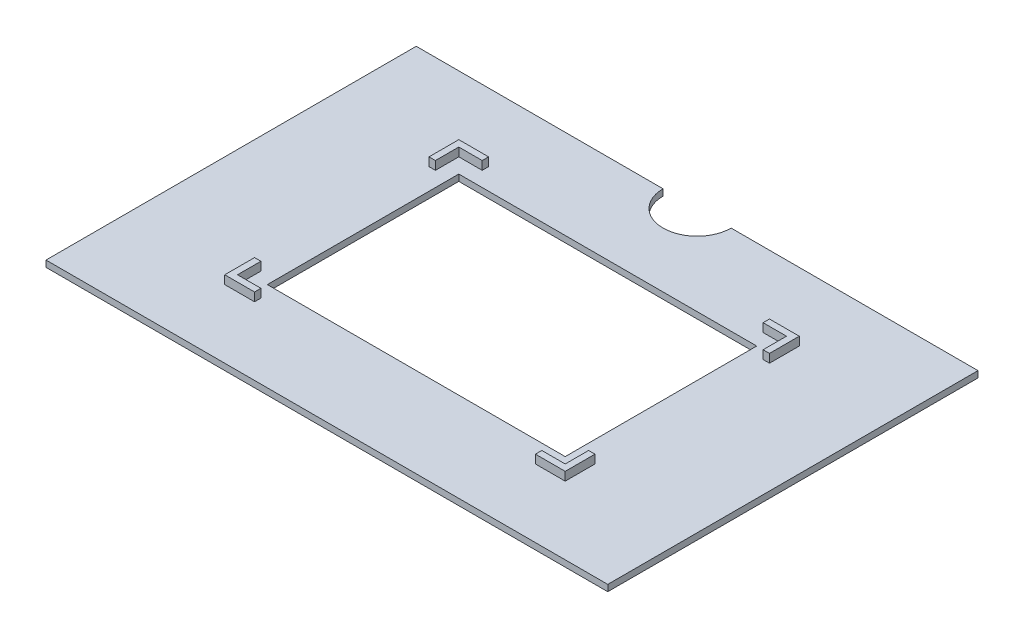
ISO-10303-21;
HEADER;
FILE_DESCRIPTION(('STEP AP214'),'2;1');
FILE_NAME('part.step','',(''),(''),'','','');
FILE_SCHEMA(('AUTOMOTIVE_DESIGN { 1 0 10303 214 1 1 1 1 }'));
ENDSEC;
DATA;
#1=APPLICATION_CONTEXT('core data for automotive mechanical design processes');
#2=APPLICATION_PROTOCOL_DEFINITION('international standard','automotive_design',2000,#1);
#3=PRODUCT_CONTEXT('',#1,'mechanical');
#4=PRODUCT('Part','Part','',(#3));
#5=PRODUCT_RELATED_PRODUCT_CATEGORY('part','',(#4));
#6=PRODUCT_DEFINITION_FORMATION('','',#4);
#7=PRODUCT_DEFINITION_CONTEXT('part definition',#1,'design');
#8=PRODUCT_DEFINITION('design','',#6,#7);
#9=PRODUCT_DEFINITION_SHAPE('','',#8);
#10=(LENGTH_UNIT() NAMED_UNIT(*) SI_UNIT(.MILLI.,.METRE.));
#11=(NAMED_UNIT(*) PLANE_ANGLE_UNIT() SI_UNIT($,.RADIAN.));
#12=(NAMED_UNIT(*) SI_UNIT($,.STERADIAN.) SOLID_ANGLE_UNIT());
#13=UNCERTAINTY_MEASURE_WITH_UNIT(LENGTH_MEASURE(1.E-05),#10,'distance_accuracy_value','');
#14=(GEOMETRIC_REPRESENTATION_CONTEXT(3) GLOBAL_UNCERTAINTY_ASSIGNED_CONTEXT((#13)) GLOBAL_UNIT_ASSIGNED_CONTEXT((#10,
#11,#12)) REPRESENTATION_CONTEXT('',''));
#15=CARTESIAN_POINT('',(0.,0.,0.));
#16=DIRECTION('',(0.,0.,1.));
#17=DIRECTION('',(1.,0.,0.));
#18=AXIS2_PLACEMENT_3D('',#15,#16,#17);
#19=CARTESIAN_POINT('',(66.,1.5,-43.5));
#20=DIRECTION('',(0.,0.,1.));
#21=DIRECTION('',(1.,0.,0.));
#22=AXIS2_PLACEMENT_3D('',#19,#20,#21);
#23=PLANE('',#22);
#24=DIRECTION('',(-1.,0.,0.));
#25=VECTOR('',#24,1.);
#26=CARTESIAN_POINT('',(66.,0.,-43.5));
#27=LINE('',#26,#25);
#28=CARTESIAN_POINT('',(66.,0.,-43.5));
#29=VERTEX_POINT('',#28);
#30=CARTESIAN_POINT('',(8.,0.,-43.5));
#31=VERTEX_POINT('',#30);
#32=EDGE_CURVE('E266',#29,#31,#27,.T.);
#33=ORIENTED_EDGE('',*,*,#32,.T.);
#34=DIRECTION('',(0.,1.,0.));
#35=VECTOR('',#34,1.);
#36=CARTESIAN_POINT('',(8.,-17.8885438199983,-43.5));
#37=LINE('',#36,#35);
#38=CARTESIAN_POINT('',(8.,1.5,-43.5));
#39=VERTEX_POINT('',#38);
#40=EDGE_CURVE('E48',#31,#39,#37,.T.);
#41=ORIENTED_EDGE('',*,*,#40,.T.);
#42=DIRECTION('',(-1.,0.,0.));
#43=VECTOR('',#42,1.);
#44=CARTESIAN_POINT('',(66.,1.5,-43.5));
#45=LINE('',#44,#43);
#46=CARTESIAN_POINT('',(66.,1.5,-43.5));
#47=VERTEX_POINT('',#46);
#48=EDGE_CURVE('E264',#47,#39,#45,.T.);
#49=ORIENTED_EDGE('',*,*,#48,.F.);
#50=DIRECTION('',(0.,-1.,0.));
#51=VECTOR('',#50,1.);
#52=CARTESIAN_POINT('',(66.,1.5,-43.5));
#53=LINE('',#52,#51);
#54=EDGE_CURVE('E277',#47,#29,#53,.T.);
#55=ORIENTED_EDGE('',*,*,#54,.T.);
#56=EDGE_LOOP('',(#33,#41,#49,#55));
#57=FACE_BOUND('',#56,.T.);
#58=ADVANCED_FACE('F33',(#57),#23,.F.);
#59=CARTESIAN_POINT('',(40.,3.5,27.5));
#60=DIRECTION('',(0.,0.,-1.));
#61=DIRECTION('',(-1.,0.,0.));
#62=AXIS2_PLACEMENT_3D('',#59,#60,#61);
#63=PLANE('',#62);
#64=DIRECTION('',(1.,0.,0.));
#65=VECTOR('',#64,1.);
#66=CARTESIAN_POINT('',(40.,1.5,27.5));
#67=LINE('',#66,#65);
#68=CARTESIAN_POINT('',(-40.,1.5,27.5));
#69=VERTEX_POINT('',#68);
#70=CARTESIAN_POINT('',(-33.,1.5,27.5));
#71=VERTEX_POINT('',#70);
#72=EDGE_CURVE('E475',#69,#71,#67,.T.);
#73=ORIENTED_EDGE('',*,*,#72,.T.);
#74=DIRECTION('',(0.,1.,0.));
#75=VECTOR('',#74,1.);
#76=CARTESIAN_POINT('',(-33.,-64.5170432539962,27.5));
#77=LINE('',#76,#75);
#78=CARTESIAN_POINT('',(-33.,3.5,27.5));
#79=VERTEX_POINT('',#78);
#80=EDGE_CURVE('E311',#71,#79,#77,.T.);
#81=ORIENTED_EDGE('',*,*,#80,.T.);
#82=DIRECTION('',(1.,0.,0.));
#83=VECTOR('',#82,1.);
#84=CARTESIAN_POINT('',(40.,3.5,27.5));
#85=LINE('',#84,#83);
#86=CARTESIAN_POINT('',(-40.,3.5,27.5));
#87=VERTEX_POINT('',#86);
#88=EDGE_CURVE('E459',#87,#79,#85,.T.);
#89=ORIENTED_EDGE('',*,*,#88,.F.);
#90=DIRECTION('',(0.,-1.,0.));
#91=VECTOR('',#90,1.);
#92=CARTESIAN_POINT('',(-40.,3.5,27.5));
#93=LINE('',#92,#91);
#94=EDGE_CURVE('E286',#87,#69,#93,.T.);
#95=ORIENTED_EDGE('',*,*,#94,.T.);
#96=EDGE_LOOP('',(#73,#81,#89,#95));
#97=FACE_BOUND('',#96,.T.);
#98=ADVANCED_FACE('F516',(#97),#63,.F.);
#99=CARTESIAN_POINT('',(0.,3.5,0.));
#100=DIRECTION('',(0.,1.,0.));
#101=DIRECTION('',(0.,0.,1.));
#102=AXIS2_PLACEMENT_3D('',#99,#100,#101);
#103=PLANE('',#102);
#104=DIRECTION('',(0.,0.,1.));
#105=VECTOR('',#104,1.);
#106=CARTESIAN_POINT('',(-33.,3.5,27.5));
#107=LINE('',#106,#105);
#108=CARTESIAN_POINT('',(-33.,3.5,26.));
#109=VERTEX_POINT('',#108);
#110=EDGE_CURVE('E306',#109,#79,#107,.T.);
#111=ORIENTED_EDGE('',*,*,#110,.F.);
#112=DIRECTION('',(1.,0.,0.));
#113=VECTOR('',#112,1.);
#114=CARTESIAN_POINT('',(38.5,3.5,26.));
#115=LINE('',#114,#113);
#116=CARTESIAN_POINT('',(-38.5,3.5,26.));
#117=VERTEX_POINT('',#116);
#118=EDGE_CURVE('E431',#117,#109,#115,.T.);
#119=ORIENTED_EDGE('',*,*,#118,.F.);
#120=DIRECTION('',(0.,0.,1.));
#121=VECTOR('',#120,1.);
#122=CARTESIAN_POINT('',(-38.5,3.5,26.));
#123=LINE('',#122,#121);
#124=CARTESIAN_POINT('',(-38.5,3.5,20.5));
#125=VERTEX_POINT('',#124);
#126=EDGE_CURVE('E409',#125,#117,#123,.T.);
#127=ORIENTED_EDGE('',*,*,#126,.F.);
#128=DIRECTION('',(1.,0.,0.));
#129=VECTOR('',#128,1.);
#130=CARTESIAN_POINT('',(-38.5,3.5,20.5));
#131=LINE('',#130,#129);
#132=CARTESIAN_POINT('',(-40.,3.5,20.5));
#133=VERTEX_POINT('',#132);
#134=EDGE_CURVE('E366',#133,#125,#131,.T.);
#135=ORIENTED_EDGE('',*,*,#134,.F.);
#136=DIRECTION('',(0.,0.,1.));
#137=VECTOR('',#136,1.);
#138=CARTESIAN_POINT('',(-40.,3.5,27.5));
#139=LINE('',#138,#137);
#140=EDGE_CURVE('E458',#133,#87,#139,.T.);
#141=ORIENTED_EDGE('',*,*,#140,.T.);
#142=ORIENTED_EDGE('',*,*,#88,.T.);
#143=EDGE_LOOP('',(#111,#119,#127,#135,#141,#142));
#144=FACE_BOUND('',#143,.T.);
#145=ADVANCED_FACE('F520',(#144),#103,.T.);
#146=CARTESIAN_POINT('',(38.5,1.5,26.));
#147=DIRECTION('',(0.,0.,1.));
#148=DIRECTION('',(1.,0.,0.));
#149=AXIS2_PLACEMENT_3D('',#146,#147,#148);
#150=PLANE('',#149);
#151=ORIENTED_EDGE('',*,*,#118,.T.);
#152=DIRECTION('',(0.,1.,0.));
#153=VECTOR('',#152,1.);
#154=CARTESIAN_POINT('',(-33.,-64.5170432539962,26.));
#155=LINE('',#154,#153);
#156=CARTESIAN_POINT('',(-33.,1.5,26.));
#157=VERTEX_POINT('',#156);
#158=EDGE_CURVE('E317',#157,#109,#155,.T.);
#159=ORIENTED_EDGE('',*,*,#158,.F.);
#160=DIRECTION('',(1.,0.,0.));
#161=VECTOR('',#160,1.);
#162=CARTESIAN_POINT('',(38.5,1.5,26.));
#163=LINE('',#162,#161);
#164=CARTESIAN_POINT('',(-38.5,1.5,26.));
#165=VERTEX_POINT('',#164);
#166=EDGE_CURVE('E415',#165,#157,#163,.T.);
#167=ORIENTED_EDGE('',*,*,#166,.F.);
#168=DIRECTION('',(0.,1.,0.));
#169=VECTOR('',#168,1.);
#170=CARTESIAN_POINT('',(-38.5,1.5,26.));
#171=LINE('',#170,#169);
#172=EDGE_CURVE('E426',#165,#117,#171,.T.);
#173=ORIENTED_EDGE('',*,*,#172,.T.);
#174=EDGE_LOOP('',(#151,#159,#167,#173));
#175=FACE_BOUND('',#174,.T.);
#176=ADVANCED_FACE('F527',(#175),#150,.F.);
#177=DIRECTION('',(0.,0.,1.));
#178=VECTOR('',#177,1.);
#179=CARTESIAN_POINT('',(-33.,3.5,-27.5));
#180=LINE('',#179,#178);
#181=CARTESIAN_POINT('',(-33.,3.5,-27.5));
#182=VERTEX_POINT('',#181);
#183=CARTESIAN_POINT('',(-33.,3.5,-26.));
#184=VERTEX_POINT('',#183);
#185=EDGE_CURVE('E324',#182,#184,#180,.T.);
#186=ORIENTED_EDGE('',*,*,#185,.F.);
#187=DIRECTION('',(-1.,0.,0.));
#188=VECTOR('',#187,1.);
#189=CARTESIAN_POINT('',(40.,3.5,-27.5));
#190=LINE('',#189,#188);
#191=CARTESIAN_POINT('',(-40.,3.5,-27.5));
#192=VERTEX_POINT('',#191);
#193=EDGE_CURVE('E466',#182,#192,#190,.T.);
#194=ORIENTED_EDGE('',*,*,#193,.T.);
#195=CARTESIAN_POINT('',(-40.,3.5,-20.5));
#196=VERTEX_POINT('',#195);
#197=EDGE_CURVE('E454',#192,#196,#139,.T.);
#198=ORIENTED_EDGE('',*,*,#197,.T.);
#199=DIRECTION('',(-1.,0.,0.));
#200=VECTOR('',#199,1.);
#201=CARTESIAN_POINT('',(-38.5,3.5,-20.5));
#202=LINE('',#201,#200);
#203=CARTESIAN_POINT('',(-38.5,3.5,-20.5));
#204=VERTEX_POINT('',#203);
#205=EDGE_CURVE('E360',#204,#196,#202,.T.);
#206=ORIENTED_EDGE('',*,*,#205,.F.);
#207=CARTESIAN_POINT('',(-38.5,3.5,-26.));
#208=VERTEX_POINT('',#207);
#209=EDGE_CURVE('E427',#208,#204,#123,.T.);
#210=ORIENTED_EDGE('',*,*,#209,.F.);
#211=DIRECTION('',(-1.,0.,0.));
#212=VECTOR('',#211,1.);
#213=CARTESIAN_POINT('',(38.5,3.5,-26.));
#214=LINE('',#213,#212);
#215=EDGE_CURVE('E438',#184,#208,#214,.T.);
#216=ORIENTED_EDGE('',*,*,#215,.F.);
#217=EDGE_LOOP('',(#186,#194,#198,#206,#210,#216));
#218=FACE_BOUND('',#217,.T.);
#219=ADVANCED_FACE('F530',(#218),#103,.T.);
#220=CARTESIAN_POINT('',(40.,3.5,-27.5));
#221=DIRECTION('',(0.,0.,1.));
#222=DIRECTION('',(1.,0.,0.));
#223=AXIS2_PLACEMENT_3D('',#220,#221,#222);
#224=PLANE('',#223);
#225=ORIENTED_EDGE('',*,*,#193,.F.);
#226=DIRECTION('',(0.,1.,0.));
#227=VECTOR('',#226,1.);
#228=CARTESIAN_POINT('',(-33.,-64.5170432539962,-27.5));
#229=LINE('',#228,#227);
#230=CARTESIAN_POINT('',(-33.,1.5,-27.5));
#231=VERTEX_POINT('',#230);
#232=EDGE_CURVE('E328',#231,#182,#229,.T.);
#233=ORIENTED_EDGE('',*,*,#232,.F.);
#234=DIRECTION('',(-1.,0.,0.));
#235=VECTOR('',#234,1.);
#236=CARTESIAN_POINT('',(40.,1.5,-27.5));
#237=LINE('',#236,#235);
#238=CARTESIAN_POINT('',(-40.,1.5,-27.5));
#239=VERTEX_POINT('',#238);
#240=EDGE_CURVE('E482',#231,#239,#237,.T.);
#241=ORIENTED_EDGE('',*,*,#240,.T.);
#242=DIRECTION('',(0.,-1.,0.));
#243=VECTOR('',#242,1.);
#244=CARTESIAN_POINT('',(-40.,3.5,-27.5));
#245=LINE('',#244,#243);
#246=EDGE_CURVE('E470',#192,#239,#245,.T.);
#247=ORIENTED_EDGE('',*,*,#246,.F.);
#248=EDGE_LOOP('',(#225,#233,#241,#247));
#249=FACE_BOUND('',#248,.T.);
#250=ADVANCED_FACE('F627',(#249),#224,.F.);
#251=CARTESIAN_POINT('',(38.5,1.5,-26.));
#252=DIRECTION('',(0.,0.,-1.));
#253=DIRECTION('',(-1.,0.,0.));
#254=AXIS2_PLACEMENT_3D('',#251,#252,#253);
#255=PLANE('',#254);
#256=DIRECTION('',(-1.,0.,0.));
#257=VECTOR('',#256,1.);
#258=CARTESIAN_POINT('',(38.5,1.5,-26.));
#259=LINE('',#258,#257);
#260=CARTESIAN_POINT('',(-33.,1.5,-26.));
#261=VERTEX_POINT('',#260);
#262=CARTESIAN_POINT('',(-38.5,1.5,-26.));
#263=VERTEX_POINT('',#262);
#264=EDGE_CURVE('E422',#261,#263,#259,.T.);
#265=ORIENTED_EDGE('',*,*,#264,.F.);
#266=DIRECTION('',(0.,1.,0.));
#267=VECTOR('',#266,1.);
#268=CARTESIAN_POINT('',(-33.,-64.5170432539962,-26.));
#269=LINE('',#268,#267);
#270=EDGE_CURVE('E334',#261,#184,#269,.T.);
#271=ORIENTED_EDGE('',*,*,#270,.T.);
#272=ORIENTED_EDGE('',*,*,#215,.T.);
#273=DIRECTION('',(0.,1.,0.));
#274=VECTOR('',#273,1.);
#275=CARTESIAN_POINT('',(-38.5,1.5,-26.));
#276=LINE('',#275,#274);
#277=EDGE_CURVE('E442',#263,#208,#276,.T.);
#278=ORIENTED_EDGE('',*,*,#277,.F.);
#279=EDGE_LOOP('',(#265,#271,#272,#278));
#280=FACE_BOUND('',#279,.T.);
#281=ADVANCED_FACE('F613',(#280),#255,.F.);
#282=CARTESIAN_POINT('',(40.,3.5,27.5));
#283=DIRECTION('',(-1.,0.,0.));
#284=DIRECTION('',(0.,0.,1.));
#285=AXIS2_PLACEMENT_3D('',#282,#283,#284);
#286=PLANE('',#285);
#287=DIRECTION('',(0.,0.,-1.));
#288=VECTOR('',#287,1.);
#289=CARTESIAN_POINT('',(40.,3.5,27.5));
#290=LINE('',#289,#288);
#291=CARTESIAN_POINT('',(40.,3.5,-20.5));
#292=VERTEX_POINT('',#291);
#293=CARTESIAN_POINT('',(40.,3.5,-27.5));
#294=VERTEX_POINT('',#293);
#295=EDGE_CURVE('E462',#292,#294,#290,.T.);
#296=ORIENTED_EDGE('',*,*,#295,.F.);
#297=DIRECTION('',(0.,1.,0.));
#298=VECTOR('',#297,1.);
#299=CARTESIAN_POINT('',(40.,-64.5170432539962,-20.5));
#300=LINE('',#299,#298);
#301=CARTESIAN_POINT('',(40.,1.5,-20.5));
#302=VERTEX_POINT('',#301);
#303=EDGE_CURVE('E353',#302,#292,#300,.T.);
#304=ORIENTED_EDGE('',*,*,#303,.F.);
#305=DIRECTION('',(0.,0.,-1.));
#306=VECTOR('',#305,1.);
#307=CARTESIAN_POINT('',(40.,1.5,27.5));
#308=LINE('',#307,#306);
#309=CARTESIAN_POINT('',(40.,1.5,-27.5));
#310=VERTEX_POINT('',#309);
#311=EDGE_CURVE('E478',#302,#310,#308,.T.);
#312=ORIENTED_EDGE('',*,*,#311,.T.);
#313=DIRECTION('',(0.,-1.,0.));
#314=VECTOR('',#313,1.);
#315=CARTESIAN_POINT('',(40.,3.5,-27.5));
#316=LINE('',#315,#314);
#317=EDGE_CURVE('E488',#294,#310,#316,.T.);
#318=ORIENTED_EDGE('',*,*,#317,.F.);
#319=EDGE_LOOP('',(#296,#304,#312,#318));
#320=FACE_BOUND('',#319,.T.);
#321=ADVANCED_FACE('F543',(#320),#286,.F.);
#322=DIRECTION('',(0.,0.,-1.));
#323=VECTOR('',#322,1.);
#324=CARTESIAN_POINT('',(33.,3.5,-27.5));
#325=LINE('',#324,#323);
#326=CARTESIAN_POINT('',(33.,3.5,-26.));
#327=VERTEX_POINT('',#326);
#328=CARTESIAN_POINT('',(33.,3.5,-27.5));
#329=VERTEX_POINT('',#328);
#330=EDGE_CURVE('E332',#327,#329,#325,.T.);
#331=ORIENTED_EDGE('',*,*,#330,.F.);
#332=CARTESIAN_POINT('',(38.5,3.5,-26.));
#333=VERTEX_POINT('',#332);
#334=EDGE_CURVE('E439',#333,#327,#214,.T.);
#335=ORIENTED_EDGE('',*,*,#334,.F.);
#336=DIRECTION('',(0.,0.,-1.));
#337=VECTOR('',#336,1.);
#338=CARTESIAN_POINT('',(38.5,3.5,26.));
#339=LINE('',#338,#337);
#340=CARTESIAN_POINT('',(38.5,3.5,-20.5));
#341=VERTEX_POINT('',#340);
#342=EDGE_CURVE('E434',#341,#333,#339,.T.);
#343=ORIENTED_EDGE('',*,*,#342,.F.);
#344=DIRECTION('',(-1.,0.,0.));
#345=VECTOR('',#344,1.);
#346=CARTESIAN_POINT('',(38.5,3.5,-20.5));
#347=LINE('',#346,#345);
#348=EDGE_CURVE('E348',#292,#341,#347,.T.);
#349=ORIENTED_EDGE('',*,*,#348,.F.);
#350=ORIENTED_EDGE('',*,*,#295,.T.);
#351=EDGE_CURVE('E467',#294,#329,#190,.T.);
#352=ORIENTED_EDGE('',*,*,#351,.T.);
#353=EDGE_LOOP('',(#331,#335,#343,#349,#350,#352));
#354=FACE_BOUND('',#353,.T.);
#355=ADVANCED_FACE('F624',(#354),#103,.T.);
#356=CARTESIAN_POINT('',(38.5,1.5,26.));
#357=DIRECTION('',(1.,0.,0.));
#358=DIRECTION('',(0.,0.,-1.));
#359=AXIS2_PLACEMENT_3D('',#356,#357,#358);
#360=PLANE('',#359);
#361=DIRECTION('',(0.,0.,-1.));
#362=VECTOR('',#361,1.);
#363=CARTESIAN_POINT('',(38.5,1.5,26.));
#364=LINE('',#363,#362);
#365=CARTESIAN_POINT('',(38.5,1.5,-20.5));
#366=VERTEX_POINT('',#365);
#367=CARTESIAN_POINT('',(38.5,1.5,-26.));
#368=VERTEX_POINT('',#367);
#369=EDGE_CURVE('E418',#366,#368,#364,.T.);
#370=ORIENTED_EDGE('',*,*,#369,.F.);
#371=DIRECTION('',(0.,1.,0.));
#372=VECTOR('',#371,1.);
#373=CARTESIAN_POINT('',(38.5,-64.5170432539962,-20.5));
#374=LINE('',#373,#372);
#375=EDGE_CURVE('E346',#366,#341,#374,.T.);
#376=ORIENTED_EDGE('',*,*,#375,.T.);
#377=ORIENTED_EDGE('',*,*,#342,.T.);
#378=DIRECTION('',(0.,1.,0.));
#379=VECTOR('',#378,1.);
#380=CARTESIAN_POINT('',(38.5,1.5,-26.));
#381=LINE('',#380,#379);
#382=EDGE_CURVE('E446',#368,#333,#381,.T.);
#383=ORIENTED_EDGE('',*,*,#382,.F.);
#384=EDGE_LOOP('',(#370,#376,#377,#383));
#385=FACE_BOUND('',#384,.T.);
#386=ADVANCED_FACE('F616',(#385),#360,.F.);
#387=CARTESIAN_POINT('',(-40.,3.5,27.5));
#388=DIRECTION('',(1.,0.,0.));
#389=DIRECTION('',(0.,0.,-1.));
#390=AXIS2_PLACEMENT_3D('',#387,#388,#389);
#391=PLANE('',#390);
#392=ORIENTED_EDGE('',*,*,#140,.F.);
#393=DIRECTION('',(0.,1.,0.));
#394=VECTOR('',#393,1.);
#395=CARTESIAN_POINT('',(-40.,-64.5170432539962,20.5));
#396=LINE('',#395,#394);
#397=CARTESIAN_POINT('',(-40.,1.5,20.5));
#398=VERTEX_POINT('',#397);
#399=EDGE_CURVE('E371',#398,#133,#396,.T.);
#400=ORIENTED_EDGE('',*,*,#399,.F.);
#401=DIRECTION('',(0.,0.,1.));
#402=VECTOR('',#401,1.);
#403=CARTESIAN_POINT('',(-40.,1.5,27.5));
#404=LINE('',#403,#402);
#405=EDGE_CURVE('E445',#398,#69,#404,.T.);
#406=ORIENTED_EDGE('',*,*,#405,.T.);
#407=ORIENTED_EDGE('',*,*,#94,.F.);
#408=EDGE_LOOP('',(#392,#400,#406,#407));
#409=FACE_BOUND('',#408,.T.);
#410=ADVANCED_FACE('F545',(#409),#391,.F.);
#411=CARTESIAN_POINT('',(-38.5,1.5,26.));
#412=DIRECTION('',(-1.,0.,0.));
#413=DIRECTION('',(0.,0.,1.));
#414=AXIS2_PLACEMENT_3D('',#411,#412,#413);
#415=PLANE('',#414);
#416=DIRECTION('',(0.,0.,1.));
#417=VECTOR('',#416,1.);
#418=CARTESIAN_POINT('',(-38.5,1.5,26.));
#419=LINE('',#418,#417);
#420=CARTESIAN_POINT('',(-38.5,1.5,20.5));
#421=VERTEX_POINT('',#420);
#422=EDGE_CURVE('E414',#421,#165,#419,.T.);
#423=ORIENTED_EDGE('',*,*,#422,.F.);
#424=DIRECTION('',(0.,1.,0.));
#425=VECTOR('',#424,1.);
#426=CARTESIAN_POINT('',(-38.5,-64.5170432539962,20.5));
#427=LINE('',#426,#425);
#428=EDGE_CURVE('E364',#421,#125,#427,.T.);
#429=ORIENTED_EDGE('',*,*,#428,.T.);
#430=ORIENTED_EDGE('',*,*,#126,.T.);
#431=ORIENTED_EDGE('',*,*,#172,.F.);
#432=EDGE_LOOP('',(#423,#429,#430,#431));
#433=FACE_BOUND('',#432,.T.);
#434=ADVANCED_FACE('F621',(#433),#415,.F.);
#435=CARTESIAN_POINT('',(0.,1.5,0.));
#436=DIRECTION('',(0.,1.,0.));
#437=DIRECTION('',(0.,0.,1.));
#438=AXIS2_PLACEMENT_3D('',#435,#436,#437);
#439=PLANE('',#438);
#440=CARTESIAN_POINT('',(0.,1.5,-43.5));
#441=DIRECTION('',(0.,1.,0.));
#442=DIRECTION('',(0.,0.,1.));
#443=AXIS2_PLACEMENT_3D('',#440,#441,#442);
#444=CIRCLE('',#443,8.);
#445=CARTESIAN_POINT('',(-8.,1.5,-43.5));
#446=VERTEX_POINT('',#445);
#447=EDGE_CURVE('E252',#446,#39,#444,.T.);
#448=ORIENTED_EDGE('',*,*,#447,.F.);
#449=CARTESIAN_POINT('',(-66.,1.5,-43.5));
#450=VERTEX_POINT('',#449);
#451=EDGE_CURVE('E274',#446,#450,#45,.T.);
#452=ORIENTED_EDGE('',*,*,#451,.T.);
#453=DIRECTION('',(0.,0.,1.));
#454=VECTOR('',#453,1.);
#455=CARTESIAN_POINT('',(-66.,1.5,43.5));
#456=LINE('',#455,#454);
#457=CARTESIAN_POINT('',(-66.,1.5,43.5));
#458=VERTEX_POINT('',#457);
#459=EDGE_CURVE('E291',#450,#458,#456,.T.);
#460=ORIENTED_EDGE('',*,*,#459,.T.);
#461=DIRECTION('',(1.,0.,0.));
#462=VECTOR('',#461,1.);
#463=CARTESIAN_POINT('',(66.,1.5,43.5));
#464=LINE('',#463,#462);
#465=CARTESIAN_POINT('',(66.,1.5,43.5));
#466=VERTEX_POINT('',#465);
#467=EDGE_CURVE('E497',#458,#466,#464,.T.);
#468=ORIENTED_EDGE('',*,*,#467,.T.);
#469=DIRECTION('',(0.,0.,-1.));
#470=VECTOR('',#469,1.);
#471=CARTESIAN_POINT('',(66.,1.5,43.5));
#472=LINE('',#471,#470);
#473=EDGE_CURVE('E271',#466,#47,#472,.T.);
#474=ORIENTED_EDGE('',*,*,#473,.T.);
#475=ORIENTED_EDGE('',*,*,#48,.T.);
#476=EDGE_LOOP('',(#448,#452,#460,#468,#474,#475));
#477=FACE_BOUND('',#476,.T.);
#478=DIRECTION('',(0.,0.,-1.));
#479=VECTOR('',#478,1.);
#480=CARTESIAN_POINT('',(-33.,1.5,27.5));
#481=LINE('',#480,#479);
#482=EDGE_CURVE('E310',#71,#157,#481,.T.);
#483=ORIENTED_EDGE('',*,*,#482,.F.);
#484=ORIENTED_EDGE('',*,*,#72,.F.);
#485=ORIENTED_EDGE('',*,*,#405,.F.);
#486=DIRECTION('',(-1.,0.,0.));
#487=VECTOR('',#486,1.);
#488=CARTESIAN_POINT('',(-38.5,1.5,20.5));
#489=LINE('',#488,#487);
#490=EDGE_CURVE('E361',#421,#398,#489,.T.);
#491=ORIENTED_EDGE('',*,*,#490,.F.);
#492=ORIENTED_EDGE('',*,*,#422,.T.);
#493=ORIENTED_EDGE('',*,*,#166,.T.);
#494=EDGE_LOOP('',(#483,#484,#485,#491,#492,#493));
#495=FACE_BOUND('',#494,.T.);
#496=DIRECTION('',(0.,0.,1.));
#497=VECTOR('',#496,1.);
#498=CARTESIAN_POINT('',(33.,1.5,-27.5));
#499=LINE('',#498,#497);
#500=CARTESIAN_POINT('',(33.,1.5,-27.5));
#501=VERTEX_POINT('',#500);
#502=CARTESIAN_POINT('',(33.,1.5,-26.));
#503=VERTEX_POINT('',#502);
#504=EDGE_CURVE('E325',#501,#503,#499,.T.);
#505=ORIENTED_EDGE('',*,*,#504,.F.);
#506=EDGE_CURVE('E483',#310,#501,#237,.T.);
#507=ORIENTED_EDGE('',*,*,#506,.F.);
#508=ORIENTED_EDGE('',*,*,#311,.F.);
#509=DIRECTION('',(1.,0.,0.));
#510=VECTOR('',#509,1.);
#511=CARTESIAN_POINT('',(38.5,1.5,-20.5));
#512=LINE('',#511,#510);
#513=EDGE_CURVE('E343',#366,#302,#512,.T.);
#514=ORIENTED_EDGE('',*,*,#513,.F.);
#515=ORIENTED_EDGE('',*,*,#369,.T.);
#516=EDGE_CURVE('E423',#368,#503,#259,.T.);
#517=ORIENTED_EDGE('',*,*,#516,.T.);
#518=EDGE_LOOP('',(#505,#507,#508,#514,#515,#517));
#519=FACE_BOUND('',#518,.T.);
#520=DIRECTION('',(-1.,0.,0.));
#521=VECTOR('',#520,1.);
#522=CARTESIAN_POINT('',(38.5,1.5,20.5));
#523=LINE('',#522,#521);
#524=CARTESIAN_POINT('',(40.,1.5,20.5));
#525=VERTEX_POINT('',#524);
#526=CARTESIAN_POINT('',(38.5,1.5,20.5));
#527=VERTEX_POINT('',#526);
#528=EDGE_CURVE('E345',#525,#527,#523,.T.);
#529=ORIENTED_EDGE('',*,*,#528,.F.);
#530=CARTESIAN_POINT('',(40.,1.5,27.5));
#531=VERTEX_POINT('',#530);
#532=EDGE_CURVE('E479',#531,#525,#308,.T.);
#533=ORIENTED_EDGE('',*,*,#532,.F.);
#534=CARTESIAN_POINT('',(33.,1.5,27.5));
#535=VERTEX_POINT('',#534);
#536=EDGE_CURVE('E474',#535,#531,#67,.T.);
#537=ORIENTED_EDGE('',*,*,#536,.F.);
#538=DIRECTION('',(0.,0.,1.));
#539=VECTOR('',#538,1.);
#540=CARTESIAN_POINT('',(33.,1.5,27.5));
#541=LINE('',#540,#539);
#542=CARTESIAN_POINT('',(33.,1.5,26.));
#543=VERTEX_POINT('',#542);
#544=EDGE_CURVE('E56',#543,#535,#541,.T.);
#545=ORIENTED_EDGE('',*,*,#544,.F.);
#546=CARTESIAN_POINT('',(38.5,1.5,26.));
#547=VERTEX_POINT('',#546);
#548=EDGE_CURVE('E413',#543,#547,#163,.T.);
#549=ORIENTED_EDGE('',*,*,#548,.T.);
#550=EDGE_CURVE('E419',#547,#527,#364,.T.);
#551=ORIENTED_EDGE('',*,*,#550,.T.);
#552=EDGE_LOOP('',(#529,#533,#537,#545,#549,#551));
#553=FACE_BOUND('',#552,.T.);
#554=ORIENTED_EDGE('',*,*,#240,.F.);
#555=DIRECTION('',(0.,0.,-1.));
#556=VECTOR('',#555,1.);
#557=CARTESIAN_POINT('',(-33.,1.5,-27.5));
#558=LINE('',#557,#556);
#559=EDGE_CURVE('E327',#261,#231,#558,.T.);
#560=ORIENTED_EDGE('',*,*,#559,.F.);
#561=ORIENTED_EDGE('',*,*,#264,.T.);
#562=CARTESIAN_POINT('',(-38.5,1.5,-20.5));
#563=VERTEX_POINT('',#562);
#564=EDGE_CURVE('E410',#263,#563,#419,.T.);
#565=ORIENTED_EDGE('',*,*,#564,.T.);
#566=DIRECTION('',(1.,0.,0.));
#567=VECTOR('',#566,1.);
#568=CARTESIAN_POINT('',(-38.5,1.5,-20.5));
#569=LINE('',#568,#567);
#570=CARTESIAN_POINT('',(-40.,1.5,-20.5));
#571=VERTEX_POINT('',#570);
#572=EDGE_CURVE('E363',#571,#563,#569,.T.);
#573=ORIENTED_EDGE('',*,*,#572,.F.);
#574=EDGE_CURVE('E471',#239,#571,#404,.T.);
#575=ORIENTED_EDGE('',*,*,#574,.F.);
#576=EDGE_LOOP('',(#554,#560,#561,#565,#573,#575));
#577=FACE_BOUND('',#576,.T.);
#578=DIRECTION('',(0.,0.,-1.));
#579=VECTOR('',#578,1.);
#580=CARTESIAN_POINT('',(35.,1.5,-22.5));
#581=LINE('',#580,#579);
#582=CARTESIAN_POINT('',(35.,1.5,22.5));
#583=VERTEX_POINT('',#582);
#584=CARTESIAN_POINT('',(35.,1.5,-22.5));
#585=VERTEX_POINT('',#584);
#586=EDGE_CURVE('E386',#583,#585,#581,.T.);
#587=ORIENTED_EDGE('',*,*,#586,.F.);
#588=DIRECTION('',(1.,0.,0.));
#589=VECTOR('',#588,1.);
#590=CARTESIAN_POINT('',(-35.,1.5,22.5));
#591=LINE('',#590,#589);
#592=CARTESIAN_POINT('',(-35.,1.5,22.5));
#593=VERTEX_POINT('',#592);
#594=EDGE_CURVE('E394',#593,#583,#591,.T.);
#595=ORIENTED_EDGE('',*,*,#594,.F.);
#596=DIRECTION('',(0.,0.,1.));
#597=VECTOR('',#596,1.);
#598=CARTESIAN_POINT('',(-35.,1.5,-22.5));
#599=LINE('',#598,#597);
#600=CARTESIAN_POINT('',(-35.,1.5,-22.5));
#601=VERTEX_POINT('',#600);
#602=EDGE_CURVE('E391',#601,#593,#599,.T.);
#603=ORIENTED_EDGE('',*,*,#602,.F.);
#604=DIRECTION('',(-1.,0.,0.));
#605=VECTOR('',#604,1.);
#606=CARTESIAN_POINT('',(-35.,1.5,-22.5));
#607=LINE('',#606,#605);
#608=EDGE_CURVE('E388',#585,#601,#607,.T.);
#609=ORIENTED_EDGE('',*,*,#608,.F.);
#610=EDGE_LOOP('',(#587,#595,#603,#609));
#611=FACE_BOUND('',#610,.T.);
#612=ADVANCED_FACE('F268',(#477,#495,#519,#553,#577,#611),#439,.T.);
#613=CARTESIAN_POINT('',(-66.,1.5,43.5));
#614=DIRECTION('',(1.,0.,0.));
#615=DIRECTION('',(0.,0.,-1.));
#616=AXIS2_PLACEMENT_3D('',#613,#614,#615);
#617=PLANE('',#616);
#618=DIRECTION('',(0.,0.,1.));
#619=VECTOR('',#618,1.);
#620=CARTESIAN_POINT('',(-66.,0.,43.5));
#621=LINE('',#620,#619);
#622=CARTESIAN_POINT('',(-66.,0.,-43.5));
#623=VERTEX_POINT('',#622);
#624=CARTESIAN_POINT('',(-66.,0.,43.5));
#625=VERTEX_POINT('',#624);
#626=EDGE_CURVE('E282',#623,#625,#621,.T.);
#627=ORIENTED_EDGE('',*,*,#626,.T.);
#628=DIRECTION('',(0.,-1.,0.));
#629=VECTOR('',#628,1.);
#630=CARTESIAN_POINT('',(-66.,1.5,43.5));
#631=LINE('',#630,#629);
#632=EDGE_CURVE('E11',#458,#625,#631,.T.);
#633=ORIENTED_EDGE('',*,*,#632,.F.);
#634=ORIENTED_EDGE('',*,*,#459,.F.);
#635=DIRECTION('',(0.,-1.,0.));
#636=VECTOR('',#635,1.);
#637=CARTESIAN_POINT('',(-66.,1.5,-43.5));
#638=LINE('',#637,#636);
#639=EDGE_CURVE('E273',#450,#623,#638,.T.);
#640=ORIENTED_EDGE('',*,*,#639,.T.);
#641=EDGE_LOOP('',(#627,#633,#634,#640));
#642=FACE_BOUND('',#641,.T.);
#643=ADVANCED_FACE('F35',(#642),#617,.F.);
#644=CARTESIAN_POINT('',(66.,1.5,43.5));
#645=DIRECTION('',(0.,0.,-1.));
#646=DIRECTION('',(-1.,0.,0.));
#647=AXIS2_PLACEMENT_3D('',#644,#645,#646);
#648=PLANE('',#647);
#649=DIRECTION('',(1.,0.,0.));
#650=VECTOR('',#649,1.);
#651=CARTESIAN_POINT('',(66.,0.,43.5));
#652=LINE('',#651,#650);
#653=CARTESIAN_POINT('',(66.,0.,43.5));
#654=VERTEX_POINT('',#653);
#655=EDGE_CURVE('E285',#625,#654,#652,.T.);
#656=ORIENTED_EDGE('',*,*,#655,.T.);
#657=DIRECTION('',(0.,-1.,0.));
#658=VECTOR('',#657,1.);
#659=CARTESIAN_POINT('',(66.,1.5,43.5));
#660=LINE('',#659,#658);
#661=EDGE_CURVE('E41',#466,#654,#660,.T.);
#662=ORIENTED_EDGE('',*,*,#661,.F.);
#663=ORIENTED_EDGE('',*,*,#467,.F.);
#664=ORIENTED_EDGE('',*,*,#632,.T.);
#665=EDGE_LOOP('',(#656,#662,#663,#664));
#666=FACE_BOUND('',#665,.T.);
#667=ADVANCED_FACE('F500',(#666),#648,.F.);
#668=CARTESIAN_POINT('',(66.,1.5,43.5));
#669=DIRECTION('',(-1.,0.,0.));
#670=DIRECTION('',(0.,0.,1.));
#671=AXIS2_PLACEMENT_3D('',#668,#669,#670);
#672=PLANE('',#671);
#673=DIRECTION('',(0.,0.,-1.));
#674=VECTOR('',#673,1.);
#675=CARTESIAN_POINT('',(66.,0.,43.5));
#676=LINE('',#675,#674);
#677=EDGE_CURVE('E288',#654,#29,#676,.T.);
#678=ORIENTED_EDGE('',*,*,#677,.T.);
#679=ORIENTED_EDGE('',*,*,#54,.F.);
#680=ORIENTED_EDGE('',*,*,#473,.F.);
#681=ORIENTED_EDGE('',*,*,#661,.T.);
#682=EDGE_LOOP('',(#678,#679,#680,#681));
#683=FACE_BOUND('',#682,.T.);
#684=ADVANCED_FACE('F297',(#683),#672,.F.);
#685=ORIENTED_EDGE('',*,*,#451,.F.);
#686=DIRECTION('',(0.,1.,0.));
#687=VECTOR('',#686,1.);
#688=CARTESIAN_POINT('',(-8.,-17.8885438199983,-43.5));
#689=LINE('',#688,#687);
#690=CARTESIAN_POINT('',(-8.,0.,-43.5));
#691=VERTEX_POINT('',#690);
#692=EDGE_CURVE('E255',#691,#446,#689,.T.);
#693=ORIENTED_EDGE('',*,*,#692,.F.);
#694=EDGE_CURVE('E290',#691,#623,#27,.T.);
#695=ORIENTED_EDGE('',*,*,#694,.T.);
#696=ORIENTED_EDGE('',*,*,#639,.F.);
#697=EDGE_LOOP('',(#685,#693,#695,#696));
#698=FACE_BOUND('',#697,.T.);
#699=ADVANCED_FACE('F504',(#698),#23,.F.);
#700=CARTESIAN_POINT('',(0.,0.,0.));
#701=DIRECTION('',(0.,1.,0.));
#702=DIRECTION('',(0.,0.,1.));
#703=AXIS2_PLACEMENT_3D('',#700,#701,#702);
#704=PLANE('',#703);
#705=DIRECTION('',(-1.,0.,0.));
#706=VECTOR('',#705,1.);
#707=CARTESIAN_POINT('',(-35.,0.,22.5));
#708=LINE('',#707,#706);
#709=CARTESIAN_POINT('',(35.,0.,22.5));
#710=VERTEX_POINT('',#709);
#711=CARTESIAN_POINT('',(-35.,0.,22.5));
#712=VERTEX_POINT('',#711);
#713=EDGE_CURVE('E380',#710,#712,#708,.T.);
#714=ORIENTED_EDGE('',*,*,#713,.F.);
#715=DIRECTION('',(0.,0.,1.));
#716=VECTOR('',#715,1.);
#717=CARTESIAN_POINT('',(35.,0.,-22.5));
#718=LINE('',#717,#716);
#719=CARTESIAN_POINT('',(35.,0.,-22.5));
#720=VERTEX_POINT('',#719);
#721=EDGE_CURVE('E383',#720,#710,#718,.T.);
#722=ORIENTED_EDGE('',*,*,#721,.F.);
#723=DIRECTION('',(1.,0.,0.));
#724=VECTOR('',#723,1.);
#725=CARTESIAN_POINT('',(-35.,0.,-22.5));
#726=LINE('',#725,#724);
#727=CARTESIAN_POINT('',(-35.,0.,-22.5));
#728=VERTEX_POINT('',#727);
#729=EDGE_CURVE('E400',#728,#720,#726,.T.);
#730=ORIENTED_EDGE('',*,*,#729,.F.);
#731=DIRECTION('',(0.,0.,-1.));
#732=VECTOR('',#731,1.);
#733=CARTESIAN_POINT('',(-35.,0.,-22.5));
#734=LINE('',#733,#732);
#735=EDGE_CURVE('E378',#712,#728,#734,.T.);
#736=ORIENTED_EDGE('',*,*,#735,.F.);
#737=EDGE_LOOP('',(#714,#722,#730,#736));
#738=FACE_BOUND('',#737,.T.);
#739=ORIENTED_EDGE('',*,*,#694,.F.);
#740=CARTESIAN_POINT('',(0.,0.,-43.5));
#741=DIRECTION('',(0.,1.,0.));
#742=DIRECTION('',(0.,0.,1.));
#743=AXIS2_PLACEMENT_3D('',#740,#741,#742);
#744=CIRCLE('',#743,8.);
#745=EDGE_CURVE('E303',#31,#691,#744,.F.);
#746=ORIENTED_EDGE('',*,*,#745,.F.);
#747=ORIENTED_EDGE('',*,*,#32,.F.);
#748=ORIENTED_EDGE('',*,*,#677,.F.);
#749=ORIENTED_EDGE('',*,*,#655,.F.);
#750=ORIENTED_EDGE('',*,*,#626,.F.);
#751=EDGE_LOOP('',(#739,#746,#747,#748,#749,#750));
#752=FACE_BOUND('',#751,.T.);
#753=ADVANCED_FACE('F301',(#738,#752),#704,.F.);
#754=ORIENTED_EDGE('',*,*,#574,.T.);
#755=DIRECTION('',(0.,1.,0.));
#756=VECTOR('',#755,1.);
#757=CARTESIAN_POINT('',(-40.,-64.5170432539962,-20.5));
#758=LINE('',#757,#756);
#759=EDGE_CURVE('E373',#571,#196,#758,.T.);
#760=ORIENTED_EDGE('',*,*,#759,.T.);
#761=ORIENTED_EDGE('',*,*,#197,.F.);
#762=ORIENTED_EDGE('',*,*,#246,.T.);
#763=EDGE_LOOP('',(#754,#760,#761,#762));
#764=FACE_BOUND('',#763,.T.);
#765=ADVANCED_FACE('F511',(#764),#391,.F.);
#766=CARTESIAN_POINT('',(33.,3.5,27.5));
#767=VERTEX_POINT('',#766);
#768=CARTESIAN_POINT('',(40.,3.5,27.5));
#769=VERTEX_POINT('',#768);
#770=EDGE_CURVE('E457',#767,#769,#85,.T.);
#771=ORIENTED_EDGE('',*,*,#770,.F.);
#772=DIRECTION('',(0.,1.,0.));
#773=VECTOR('',#772,1.);
#774=CARTESIAN_POINT('',(33.,-64.5170432539962,27.5));
#775=LINE('',#774,#773);
#776=EDGE_CURVE('E314',#535,#767,#775,.T.);
#777=ORIENTED_EDGE('',*,*,#776,.F.);
#778=ORIENTED_EDGE('',*,*,#536,.T.);
#779=DIRECTION('',(0.,-1.,0.));
#780=VECTOR('',#779,1.);
#781=CARTESIAN_POINT('',(40.,3.5,27.5));
#782=LINE('',#781,#780);
#783=EDGE_CURVE('E491',#769,#531,#782,.T.);
#784=ORIENTED_EDGE('',*,*,#783,.F.);
#785=EDGE_LOOP('',(#771,#777,#778,#784));
#786=FACE_BOUND('',#785,.T.);
#787=ADVANCED_FACE('F523',(#786),#63,.F.);
#788=ORIENTED_EDGE('',*,*,#532,.T.);
#789=DIRECTION('',(0.,1.,0.));
#790=VECTOR('',#789,1.);
#791=CARTESIAN_POINT('',(40.,-64.5170432539962,20.5));
#792=LINE('',#791,#790);
#793=CARTESIAN_POINT('',(40.,3.5,20.5));
#794=VERTEX_POINT('',#793);
#795=EDGE_CURVE('E355',#525,#794,#792,.T.);
#796=ORIENTED_EDGE('',*,*,#795,.T.);
#797=EDGE_CURVE('E463',#769,#794,#290,.T.);
#798=ORIENTED_EDGE('',*,*,#797,.F.);
#799=ORIENTED_EDGE('',*,*,#783,.T.);
#800=EDGE_LOOP('',(#788,#796,#798,#799));
#801=FACE_BOUND('',#800,.T.);
#802=ADVANCED_FACE('F535',(#801),#286,.F.);
#803=ORIENTED_EDGE('',*,*,#506,.T.);
#804=DIRECTION('',(0.,1.,0.));
#805=VECTOR('',#804,1.);
#806=CARTESIAN_POINT('',(33.,-64.5170432539962,-27.5));
#807=LINE('',#806,#805);
#808=EDGE_CURVE('E336',#501,#329,#807,.T.);
#809=ORIENTED_EDGE('',*,*,#808,.T.);
#810=ORIENTED_EDGE('',*,*,#351,.F.);
#811=ORIENTED_EDGE('',*,*,#317,.T.);
#812=EDGE_LOOP('',(#803,#809,#810,#811));
#813=FACE_BOUND('',#812,.T.);
#814=ADVANCED_FACE('F541',(#813),#224,.F.);
#815=DIRECTION('',(0.,0.,-1.));
#816=VECTOR('',#815,1.);
#817=CARTESIAN_POINT('',(33.,3.5,27.5));
#818=LINE('',#817,#816);
#819=CARTESIAN_POINT('',(33.,3.5,26.));
#820=VERTEX_POINT('',#819);
#821=EDGE_CURVE('E304',#767,#820,#818,.T.);
#822=ORIENTED_EDGE('',*,*,#821,.F.);
#823=ORIENTED_EDGE('',*,*,#770,.T.);
#824=ORIENTED_EDGE('',*,*,#797,.T.);
#825=DIRECTION('',(1.,0.,0.));
#826=VECTOR('',#825,1.);
#827=CARTESIAN_POINT('',(38.5,3.5,20.5));
#828=LINE('',#827,#826);
#829=CARTESIAN_POINT('',(38.5,3.5,20.5));
#830=VERTEX_POINT('',#829);
#831=EDGE_CURVE('E330',#830,#794,#828,.T.);
#832=ORIENTED_EDGE('',*,*,#831,.F.);
#833=CARTESIAN_POINT('',(38.5,3.5,26.));
#834=VERTEX_POINT('',#833);
#835=EDGE_CURVE('E435',#834,#830,#339,.T.);
#836=ORIENTED_EDGE('',*,*,#835,.F.);
#837=EDGE_CURVE('E430',#820,#834,#115,.T.);
#838=ORIENTED_EDGE('',*,*,#837,.F.);
#839=EDGE_LOOP('',(#822,#823,#824,#832,#836,#838));
#840=FACE_BOUND('',#839,.T.);
#841=ADVANCED_FACE('F531',(#840),#103,.T.);
#842=ORIENTED_EDGE('',*,*,#209,.T.);
#843=DIRECTION('',(0.,1.,0.));
#844=VECTOR('',#843,1.);
#845=CARTESIAN_POINT('',(-38.5,-64.5170432539962,-20.5));
#846=LINE('',#845,#844);
#847=EDGE_CURVE('E368',#563,#204,#846,.T.);
#848=ORIENTED_EDGE('',*,*,#847,.F.);
#849=ORIENTED_EDGE('',*,*,#564,.F.);
#850=ORIENTED_EDGE('',*,*,#277,.T.);
#851=EDGE_LOOP('',(#842,#848,#849,#850));
#852=FACE_BOUND('',#851,.T.);
#853=ADVANCED_FACE('F611',(#852),#415,.F.);
#854=ORIENTED_EDGE('',*,*,#334,.T.);
#855=DIRECTION('',(0.,1.,0.));
#856=VECTOR('',#855,1.);
#857=CARTESIAN_POINT('',(33.,-64.5170432539962,-26.));
#858=LINE('',#857,#856);
#859=EDGE_CURVE('E339',#503,#327,#858,.T.);
#860=ORIENTED_EDGE('',*,*,#859,.F.);
#861=ORIENTED_EDGE('',*,*,#516,.F.);
#862=ORIENTED_EDGE('',*,*,#382,.T.);
#863=EDGE_LOOP('',(#854,#860,#861,#862));
#864=FACE_BOUND('',#863,.T.);
#865=ADVANCED_FACE('F608',(#864),#255,.F.);
#866=ORIENTED_EDGE('',*,*,#835,.T.);
#867=DIRECTION('',(0.,1.,0.));
#868=VECTOR('',#867,1.);
#869=CARTESIAN_POINT('',(38.5,-64.5170432539962,20.5));
#870=LINE('',#869,#868);
#871=EDGE_CURVE('E350',#527,#830,#870,.T.);
#872=ORIENTED_EDGE('',*,*,#871,.F.);
#873=ORIENTED_EDGE('',*,*,#550,.F.);
#874=DIRECTION('',(0.,1.,0.));
#875=VECTOR('',#874,1.);
#876=CARTESIAN_POINT('',(38.5,1.5,26.));
#877=LINE('',#876,#875);
#878=EDGE_CURVE('E449',#547,#834,#877,.T.);
#879=ORIENTED_EDGE('',*,*,#878,.T.);
#880=EDGE_LOOP('',(#866,#872,#873,#879));
#881=FACE_BOUND('',#880,.T.);
#882=ADVANCED_FACE('F567',(#881),#360,.F.);
#883=ORIENTED_EDGE('',*,*,#548,.F.);
#884=DIRECTION('',(0.,1.,0.));
#885=VECTOR('',#884,1.);
#886=CARTESIAN_POINT('',(33.,-64.5170432539962,26.));
#887=LINE('',#886,#885);
#888=EDGE_CURVE('E319',#543,#820,#887,.T.);
#889=ORIENTED_EDGE('',*,*,#888,.T.);
#890=ORIENTED_EDGE('',*,*,#837,.T.);
#891=ORIENTED_EDGE('',*,*,#878,.F.);
#892=EDGE_LOOP('',(#883,#889,#890,#891));
#893=FACE_BOUND('',#892,.T.);
#894=ADVANCED_FACE('F559',(#893),#150,.F.);
#895=CARTESIAN_POINT('',(35.,-0.000999999999999916,-22.5));
#896=DIRECTION('',(1.,0.,0.));
#897=DIRECTION('',(0.,0.,-1.));
#898=AXIS2_PLACEMENT_3D('',#895,#896,#897);
#899=PLANE('',#898);
#900=ORIENTED_EDGE('',*,*,#721,.T.);
#901=DIRECTION('',(0.,1.,0.));
#902=VECTOR('',#901,1.);
#903=CARTESIAN_POINT('',(35.,-0.000999999999999916,22.5));
#904=LINE('',#903,#902);
#905=EDGE_CURVE('E398',#710,#583,#904,.T.);
#906=ORIENTED_EDGE('',*,*,#905,.T.);
#907=ORIENTED_EDGE('',*,*,#586,.T.);
#908=DIRECTION('',(0.,1.,0.));
#909=VECTOR('',#908,1.);
#910=CARTESIAN_POINT('',(35.,-0.000999999999999916,-22.5));
#911=LINE('',#910,#909);
#912=EDGE_CURVE('E397',#720,#585,#911,.T.);
#913=ORIENTED_EDGE('',*,*,#912,.F.);
#914=EDGE_LOOP('',(#900,#906,#907,#913));
#915=FACE_BOUND('',#914,.T.);
#916=ADVANCED_FACE('F597',(#915),#899,.F.);
#917=CARTESIAN_POINT('',(-35.,-0.000999999999999916,22.5));
#918=DIRECTION('',(0.,0.,1.));
#919=DIRECTION('',(1.,0.,0.));
#920=AXIS2_PLACEMENT_3D('',#917,#918,#919);
#921=PLANE('',#920);
#922=ORIENTED_EDGE('',*,*,#713,.T.);
#923=DIRECTION('',(0.,1.,0.));
#924=VECTOR('',#923,1.);
#925=CARTESIAN_POINT('',(-35.,-0.000999999999999916,22.5));
#926=LINE('',#925,#924);
#927=EDGE_CURVE('E401',#712,#593,#926,.T.);
#928=ORIENTED_EDGE('',*,*,#927,.T.);
#929=ORIENTED_EDGE('',*,*,#594,.T.);
#930=ORIENTED_EDGE('',*,*,#905,.F.);
#931=EDGE_LOOP('',(#922,#928,#929,#930));
#932=FACE_BOUND('',#931,.T.);
#933=ADVANCED_FACE('F593',(#932),#921,.F.);
#934=CARTESIAN_POINT('',(-35.,-0.000999999999999916,-22.5));
#935=DIRECTION('',(-1.,0.,0.));
#936=DIRECTION('',(0.,0.,1.));
#937=AXIS2_PLACEMENT_3D('',#934,#935,#936);
#938=PLANE('',#937);
#939=ORIENTED_EDGE('',*,*,#735,.T.);
#940=DIRECTION('',(0.,1.,0.));
#941=VECTOR('',#940,1.);
#942=CARTESIAN_POINT('',(-35.,-0.000999999999999916,-22.5));
#943=LINE('',#942,#941);
#944=EDGE_CURVE('E403',#728,#601,#943,.T.);
#945=ORIENTED_EDGE('',*,*,#944,.T.);
#946=ORIENTED_EDGE('',*,*,#602,.T.);
#947=ORIENTED_EDGE('',*,*,#927,.F.);
#948=EDGE_LOOP('',(#939,#945,#946,#947));
#949=FACE_BOUND('',#948,.T.);
#950=ADVANCED_FACE('F596',(#949),#938,.F.);
#951=CARTESIAN_POINT('',(-35.,-0.000999999999999916,-22.5));
#952=DIRECTION('',(0.,0.,-1.));
#953=DIRECTION('',(-1.,0.,0.));
#954=AXIS2_PLACEMENT_3D('',#951,#952,#953);
#955=PLANE('',#954);
#956=ORIENTED_EDGE('',*,*,#729,.T.);
#957=ORIENTED_EDGE('',*,*,#912,.T.);
#958=ORIENTED_EDGE('',*,*,#608,.T.);
#959=ORIENTED_EDGE('',*,*,#944,.F.);
#960=EDGE_LOOP('',(#956,#957,#958,#959));
#961=FACE_BOUND('',#960,.T.);
#962=ADVANCED_FACE('F588',(#961),#955,.F.);
#963=CARTESIAN_POINT('',(-38.5,-64.5170432539962,20.5));
#964=DIRECTION('',(0.,0.,1.));
#965=DIRECTION('',(1.,0.,0.));
#966=AXIS2_PLACEMENT_3D('',#963,#964,#965);
#967=PLANE('',#966);
#968=ORIENTED_EDGE('',*,*,#490,.T.);
#969=ORIENTED_EDGE('',*,*,#399,.T.);
#970=ORIENTED_EDGE('',*,*,#134,.T.);
#971=ORIENTED_EDGE('',*,*,#428,.F.);
#972=EDGE_LOOP('',(#968,#969,#970,#971));
#973=FACE_BOUND('',#972,.T.);
#974=ADVANCED_FACE('F585',(#973),#967,.F.);
#975=CARTESIAN_POINT('',(-38.5,-64.5170432539962,-20.5));
#976=DIRECTION('',(0.,0.,-1.));
#977=DIRECTION('',(-1.,0.,0.));
#978=AXIS2_PLACEMENT_3D('',#975,#976,#977);
#979=PLANE('',#978);
#980=ORIENTED_EDGE('',*,*,#572,.T.);
#981=ORIENTED_EDGE('',*,*,#847,.T.);
#982=ORIENTED_EDGE('',*,*,#205,.T.);
#983=ORIENTED_EDGE('',*,*,#759,.F.);
#984=EDGE_LOOP('',(#980,#981,#982,#983));
#985=FACE_BOUND('',#984,.T.);
#986=ADVANCED_FACE('F581',(#985),#979,.F.);
#987=CARTESIAN_POINT('',(38.5,-64.5170432539962,-20.5));
#988=DIRECTION('',(0.,0.,-1.));
#989=DIRECTION('',(-1.,0.,0.));
#990=AXIS2_PLACEMENT_3D('',#987,#988,#989);
#991=PLANE('',#990);
#992=ORIENTED_EDGE('',*,*,#513,.T.);
#993=ORIENTED_EDGE('',*,*,#303,.T.);
#994=ORIENTED_EDGE('',*,*,#348,.T.);
#995=ORIENTED_EDGE('',*,*,#375,.F.);
#996=EDGE_LOOP('',(#992,#993,#994,#995));
#997=FACE_BOUND('',#996,.T.);
#998=ADVANCED_FACE('F572',(#997),#991,.F.);
#999=CARTESIAN_POINT('',(38.5,-64.5170432539962,20.5));
#1000=DIRECTION('',(0.,0.,1.));
#1001=DIRECTION('',(1.,0.,0.));
#1002=AXIS2_PLACEMENT_3D('',#999,#1000,#1001);
#1003=PLANE('',#1002);
#1004=ORIENTED_EDGE('',*,*,#528,.T.);
#1005=ORIENTED_EDGE('',*,*,#871,.T.);
#1006=ORIENTED_EDGE('',*,*,#831,.T.);
#1007=ORIENTED_EDGE('',*,*,#795,.F.);
#1008=EDGE_LOOP('',(#1004,#1005,#1006,#1007));
#1009=FACE_BOUND('',#1008,.T.);
#1010=ADVANCED_FACE('F569',(#1009),#1003,.F.);
#1011=CARTESIAN_POINT('',(-33.,-64.5170432539962,-27.5));
#1012=DIRECTION('',(-1.,0.,0.));
#1013=DIRECTION('',(0.,0.,1.));
#1014=AXIS2_PLACEMENT_3D('',#1011,#1012,#1013);
#1015=PLANE('',#1014);
#1016=ORIENTED_EDGE('',*,*,#559,.T.);
#1017=ORIENTED_EDGE('',*,*,#232,.T.);
#1018=ORIENTED_EDGE('',*,*,#185,.T.);
#1019=ORIENTED_EDGE('',*,*,#270,.F.);
#1020=EDGE_LOOP('',(#1016,#1017,#1018,#1019));
#1021=FACE_BOUND('',#1020,.T.);
#1022=ADVANCED_FACE('F571',(#1021),#1015,.F.);
#1023=CARTESIAN_POINT('',(33.,-64.5170432539962,-27.5));
#1024=DIRECTION('',(1.,0.,0.));
#1025=DIRECTION('',(0.,0.,-1.));
#1026=AXIS2_PLACEMENT_3D('',#1023,#1024,#1025);
#1027=PLANE('',#1026);
#1028=ORIENTED_EDGE('',*,*,#504,.T.);
#1029=ORIENTED_EDGE('',*,*,#859,.T.);
#1030=ORIENTED_EDGE('',*,*,#330,.T.);
#1031=ORIENTED_EDGE('',*,*,#808,.F.);
#1032=EDGE_LOOP('',(#1028,#1029,#1030,#1031));
#1033=FACE_BOUND('',#1032,.T.);
#1034=ADVANCED_FACE('F578',(#1033),#1027,.F.);
#1035=CARTESIAN_POINT('',(-33.,-64.5170432539962,27.5));
#1036=DIRECTION('',(-1.,0.,0.));
#1037=DIRECTION('',(0.,0.,1.));
#1038=AXIS2_PLACEMENT_3D('',#1035,#1036,#1037);
#1039=PLANE('',#1038);
#1040=ORIENTED_EDGE('',*,*,#482,.T.);
#1041=ORIENTED_EDGE('',*,*,#158,.T.);
#1042=ORIENTED_EDGE('',*,*,#110,.T.);
#1043=ORIENTED_EDGE('',*,*,#80,.F.);
#1044=EDGE_LOOP('',(#1040,#1041,#1042,#1043));
#1045=FACE_BOUND('',#1044,.T.);
#1046=ADVANCED_FACE('F691',(#1045),#1039,.F.);
#1047=CARTESIAN_POINT('',(33.,-64.5170432539962,27.5));
#1048=DIRECTION('',(1.,0.,0.));
#1049=DIRECTION('',(0.,0.,-1.));
#1050=AXIS2_PLACEMENT_3D('',#1047,#1048,#1049);
#1051=PLANE('',#1050);
#1052=ORIENTED_EDGE('',*,*,#544,.T.);
#1053=ORIENTED_EDGE('',*,*,#776,.T.);
#1054=ORIENTED_EDGE('',*,*,#821,.T.);
#1055=ORIENTED_EDGE('',*,*,#888,.F.);
#1056=EDGE_LOOP('',(#1052,#1053,#1054,#1055));
#1057=FACE_BOUND('',#1056,.T.);
#1058=ADVANCED_FACE('F556',(#1057),#1051,.F.);
#1059=CARTESIAN_POINT('',(0.,-17.8885438199983,-43.5));
#1060=DIRECTION('',(0.,1.,0.));
#1061=DIRECTION('',(0.,0.,1.));
#1062=AXIS2_PLACEMENT_3D('',#1059,#1060,#1061);
#1063=CYLINDRICAL_SURFACE('',#1062,8.);
#1064=ORIENTED_EDGE('',*,*,#745,.T.);
#1065=ORIENTED_EDGE('',*,*,#692,.T.);
#1066=ORIENTED_EDGE('',*,*,#447,.T.);
#1067=ORIENTED_EDGE('',*,*,#40,.F.);
#1068=EDGE_LOOP('',(#1064,#1065,#1066,#1067));
#1069=FACE_BOUND('',#1068,.T.);
#1070=ADVANCED_FACE('F253',(#1069),#1063,.F.);
#1071=CLOSED_SHELL('',(#58,#98,#145,#176,#219,#250,#281,#321,#355,#386,#410,#434,#612,#643,#667,
#684,#699,#753,#765,#787,#802,#814,#841,#853,#865,#882,#894,#916,#933,#950,#962,#974,#986,#998,
#1010,#1022,#1034,#1046,#1058,#1070));
#1072=MANIFOLD_SOLID_BREP('B2',#1071);
#1073=ADVANCED_BREP_SHAPE_REPRESENTATION('',(#18,#1072),#14);
#1074=SHAPE_DEFINITION_REPRESENTATION(#9,#1073);
ENDSEC;
END-ISO-10303-21;
